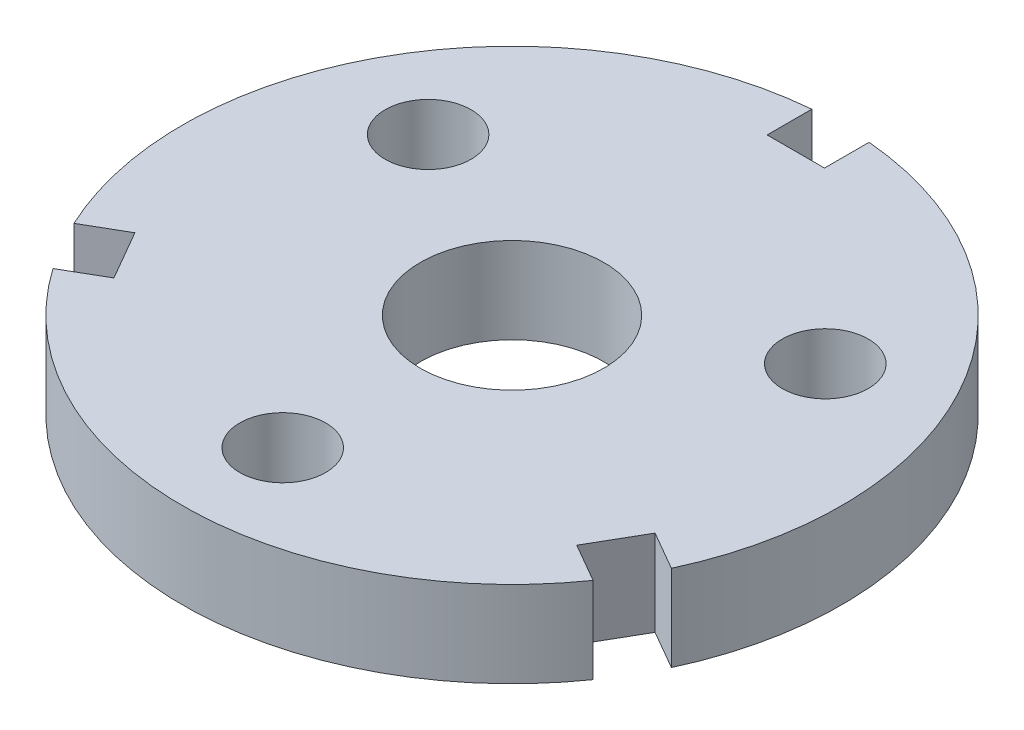
ISO-10303-21;
HEADER;
FILE_DESCRIPTION(('STEP AP214'),'2;1');
FILE_NAME('part.step','',(''),(''),'','','');
FILE_SCHEMA(('AUTOMOTIVE_DESIGN { 1 0 10303 214 1 1 1 1 }'));
ENDSEC;
DATA;
#1=APPLICATION_CONTEXT('core data for automotive mechanical design processes');
#2=APPLICATION_PROTOCOL_DEFINITION('international standard','automotive_design',2000,#1);
#3=PRODUCT_CONTEXT('',#1,'mechanical');
#4=PRODUCT('Part','Part','',(#3));
#5=PRODUCT_RELATED_PRODUCT_CATEGORY('part','',(#4));
#6=PRODUCT_DEFINITION_FORMATION('','',#4);
#7=PRODUCT_DEFINITION_CONTEXT('part definition',#1,'design');
#8=PRODUCT_DEFINITION('design','',#6,#7);
#9=PRODUCT_DEFINITION_SHAPE('','',#8);
#10=(LENGTH_UNIT() NAMED_UNIT(*) SI_UNIT(.MILLI.,.METRE.));
#11=(NAMED_UNIT(*) PLANE_ANGLE_UNIT() SI_UNIT($,.RADIAN.));
#12=(NAMED_UNIT(*) SI_UNIT($,.STERADIAN.) SOLID_ANGLE_UNIT());
#13=UNCERTAINTY_MEASURE_WITH_UNIT(LENGTH_MEASURE(1.E-05),#10,'distance_accuracy_value','');
#14=(GEOMETRIC_REPRESENTATION_CONTEXT(3) GLOBAL_UNCERTAINTY_ASSIGNED_CONTEXT((#13)) GLOBAL_UNIT_ASSIGNED_CONTEXT((#10,
#11,#12)) REPRESENTATION_CONTEXT('',''));
#15=CARTESIAN_POINT('',(0.,0.,0.));
#16=DIRECTION('',(0.,0.,1.));
#17=DIRECTION('',(1.,0.,0.));
#18=AXIS2_PLACEMENT_3D('',#15,#16,#17);
#19=CARTESIAN_POINT('',(0.,15.,0.));
#20=DIRECTION('',(0.,1.,0.));
#21=DIRECTION('',(0.,0.,1.));
#22=AXIS2_PLACEMENT_3D('',#19,#20,#21);
#23=PLANE('',#22);
#24=CARTESIAN_POINT('',(4.60582016832331E-12,15.,40.0000000000013));
#25=DIRECTION('',(0.,1.,0.));
#26=DIRECTION('',(0.,0.,1.));
#27=AXIS2_PLACEMENT_3D('',#24,#25,#26);
#28=CIRCLE('',#27,7.49999999999981);
#29=CARTESIAN_POINT('',(4.60582016832331E-12,15.,47.5000000000011));
#30=VERTEX_POINT('',#29);
#31=EDGE_CURVE('E336',#30,#30,#28,.T.);
#32=ORIENTED_EDGE('',*,*,#31,.F.);
#33=EDGE_LOOP('',(#32));
#34=FACE_BOUND('',#33,.T.);
#35=CARTESIAN_POINT('',(0.,15.,0.));
#36=DIRECTION('',(0.,1.,0.));
#37=DIRECTION('',(0.,0.,1.));
#38=AXIS2_PLACEMENT_3D('',#35,#36,#37);
#39=CIRCLE('',#38,16.);
#40=CARTESIAN_POINT('',(0.,15.,16.));
#41=VERTEX_POINT('',#40);
#42=EDGE_CURVE('E174',#41,#41,#39,.T.);
#43=ORIENTED_EDGE('',*,*,#42,.F.);
#44=EDGE_LOOP('',(#43));
#45=FACE_BOUND('',#44,.T.);
#46=CARTESIAN_POINT('',(0.,15.,0.));
#47=DIRECTION('',(0.,1.,0.));
#48=DIRECTION('',(0.,0.,1.));
#49=AXIS2_PLACEMENT_3D('',#46,#47,#48);
#50=CIRCLE('',#49,57.5);
#51=CARTESIAN_POINT('',(-5.,15.,-57.282196186948));
#52=VERTEX_POINT('',#51);
#53=CARTESIAN_POINT('',(-52.1078370824611,15.,24.3109710745518));
#54=VERTEX_POINT('',#53);
#55=EDGE_CURVE('E204',#52,#54,#50,.T.);
#56=ORIENTED_EDGE('',*,*,#55,.T.);
#57=DIRECTION('',(0.866025403784438,0.,-0.5));
#58=VECTOR('',#57,1.);
#59=CARTESIAN_POINT('',(-45.3682574873297,15.,20.4198729810778));
#60=LINE('',#59,#58);
#61=CARTESIAN_POINT('',(-45.3682574873297,15.,20.4198729810778));
#62=VERTEX_POINT('',#61);
#63=EDGE_CURVE('E116',#54,#62,#60,.T.);
#64=ORIENTED_EDGE('',*,*,#63,.T.);
#65=DIRECTION('',(0.5,0.,0.866025403784438));
#66=VECTOR('',#65,1.);
#67=CARTESIAN_POINT('',(-40.3682574873297,15.,29.0801270189222));
#68=LINE('',#67,#66);
#69=CARTESIAN_POINT('',(-40.3682574873297,15.,29.0801270189222));
#70=VERTEX_POINT('',#69);
#71=EDGE_CURVE('E241',#62,#70,#68,.T.);
#72=ORIENTED_EDGE('',*,*,#71,.T.);
#73=DIRECTION('',(-0.866025403784439,0.,0.5));
#74=VECTOR('',#73,1.);
#75=CARTESIAN_POINT('',(-47.1078370824611,15.,32.9712251123962));
#76=LINE('',#75,#74);
#77=CARTESIAN_POINT('',(-47.1078370824611,15.,32.9712251123962));
#78=VERTEX_POINT('',#77);
#79=EDGE_CURVE('E261',#70,#78,#76,.T.);
#80=ORIENTED_EDGE('',*,*,#79,.T.);
#81=CARTESIAN_POINT('',(0.,15.,0.));
#82=DIRECTION('',(0.,1.,0.));
#83=DIRECTION('',(0.,0.,1.));
#84=AXIS2_PLACEMENT_3D('',#81,#82,#83);
#85=CIRCLE('',#84,57.5);
#86=CARTESIAN_POINT('',(47.1078370824611,15.,32.9712251123962));
#87=VERTEX_POINT('',#86);
#88=EDGE_CURVE('E257',#78,#87,#85,.T.);
#89=ORIENTED_EDGE('',*,*,#88,.T.);
#90=DIRECTION('',(-0.866025403784439,0.,-0.5));
#91=VECTOR('',#90,1.);
#92=CARTESIAN_POINT('',(40.3682574873297,15.,29.0801270189222));
#93=LINE('',#92,#91);
#94=CARTESIAN_POINT('',(40.3682574873297,15.,29.0801270189222));
#95=VERTEX_POINT('',#94);
#96=EDGE_CURVE('E260',#87,#95,#93,.T.);
#97=ORIENTED_EDGE('',*,*,#96,.T.);
#98=DIRECTION('',(0.5,0.,-0.866025403784438));
#99=VECTOR('',#98,1.);
#100=CARTESIAN_POINT('',(45.3682574873297,15.,20.4198729810778));
#101=LINE('',#100,#99);
#102=CARTESIAN_POINT('',(45.3682574873297,15.,20.4198729810778));
#103=VERTEX_POINT('',#102);
#104=EDGE_CURVE('E265',#95,#103,#101,.T.);
#105=ORIENTED_EDGE('',*,*,#104,.T.);
#106=DIRECTION('',(0.866025403784439,0.,0.5));
#107=VECTOR('',#106,1.);
#108=CARTESIAN_POINT('',(52.1078370824611,15.,24.3109710745518));
#109=LINE('',#108,#107);
#110=CARTESIAN_POINT('',(52.1078370824611,15.,24.3109710745518));
#111=VERTEX_POINT('',#110);
#112=EDGE_CURVE('E272',#103,#111,#109,.T.);
#113=ORIENTED_EDGE('',*,*,#112,.T.);
#114=CARTESIAN_POINT('',(0.,15.,0.));
#115=DIRECTION('',(0.,1.,0.));
#116=DIRECTION('',(0.,0.,1.));
#117=AXIS2_PLACEMENT_3D('',#114,#115,#116);
#118=CIRCLE('',#117,57.5);
#119=CARTESIAN_POINT('',(5.,15.,-57.282196186948));
#120=VERTEX_POINT('',#119);
#121=EDGE_CURVE('E147',#111,#120,#118,.T.);
#122=ORIENTED_EDGE('',*,*,#121,.T.);
#123=DIRECTION('',(0.,0.,1.));
#124=VECTOR('',#123,1.);
#125=CARTESIAN_POINT('',(5.,15.,-49.5));
#126=LINE('',#125,#124);
#127=CARTESIAN_POINT('',(5.,15.,-49.5));
#128=VERTEX_POINT('',#127);
#129=EDGE_CURVE('E141',#120,#128,#126,.T.);
#130=ORIENTED_EDGE('',*,*,#129,.T.);
#131=DIRECTION('',(-1.,0.,0.));
#132=VECTOR('',#131,1.);
#133=CARTESIAN_POINT('',(-5.,15.,-49.5));
#134=LINE('',#133,#132);
#135=CARTESIAN_POINT('',(-5.,15.,-49.5));
#136=VERTEX_POINT('',#135);
#137=EDGE_CURVE('E145',#128,#136,#134,.T.);
#138=ORIENTED_EDGE('',*,*,#137,.T.);
#139=DIRECTION('',(0.,0.,-1.));
#140=VECTOR('',#139,1.);
#141=CARTESIAN_POINT('',(-5.,15.,-57.282196186948));
#142=LINE('',#141,#140);
#143=EDGE_CURVE('E61',#136,#52,#142,.T.);
#144=ORIENTED_EDGE('',*,*,#143,.T.);
#145=EDGE_LOOP('',(#56,#64,#72,#80,#89,#97,#105,#113,#122,#130,#138,#144));
#146=FACE_BOUND('',#145,.T.);
#147=CARTESIAN_POINT('',(34.6410161513763,15.,-20.0000000000017));
#148=DIRECTION('',(0.,1.,0.));
#149=DIRECTION('',(0.,0.,1.));
#150=AXIS2_PLACEMENT_3D('',#147,#148,#149);
#151=CIRCLE('',#150,7.50000000000065);
#152=CARTESIAN_POINT('',(34.6410161513763,15.,-12.5000000000011));
#153=VERTEX_POINT('',#152);
#154=EDGE_CURVE('E344',#153,#153,#151,.T.);
#155=ORIENTED_EDGE('',*,*,#154,.F.);
#156=EDGE_LOOP('',(#155));
#157=FACE_BOUND('',#156,.T.);
#158=CARTESIAN_POINT('',(-34.6410161513785,15.,-19.9999999999952));
#159=DIRECTION('',(0.,1.,0.));
#160=DIRECTION('',(0.,0.,1.));
#161=AXIS2_PLACEMENT_3D('',#158,#159,#160);
#162=CIRCLE('',#161,7.50000000000269);
#163=CARTESIAN_POINT('',(-34.6410161513785,15.,-12.4999999999925));
#164=VERTEX_POINT('',#163);
#165=EDGE_CURVE('E325',#164,#164,#162,.T.);
#166=ORIENTED_EDGE('',*,*,#165,.F.);
#167=EDGE_LOOP('',(#166));
#168=FACE_BOUND('',#167,.T.);
#169=ADVANCED_FACE('F43',(#34,#45,#146,#157,#168),#23,.T.);
#170=CARTESIAN_POINT('',(0.,0.,0.));
#171=DIRECTION('',(0.,1.,0.));
#172=DIRECTION('',(0.,0.,1.));
#173=AXIS2_PLACEMENT_3D('',#170,#171,#172);
#174=PLANE('',#173);
#175=CARTESIAN_POINT('',(0.,0.,0.));
#176=DIRECTION('',(0.,1.,0.));
#177=DIRECTION('',(0.,0.,1.));
#178=AXIS2_PLACEMENT_3D('',#175,#176,#177);
#179=CIRCLE('',#178,57.5);
#180=CARTESIAN_POINT('',(-5.,0.,-57.282196186948));
#181=VERTEX_POINT('',#180);
#182=CARTESIAN_POINT('',(-52.1078370824611,0.,24.3109710745518));
#183=VERTEX_POINT('',#182);
#184=EDGE_CURVE('E169',#181,#183,#179,.T.);
#185=ORIENTED_EDGE('',*,*,#184,.F.);
#186=DIRECTION('',(0.,0.,-1.));
#187=VECTOR('',#186,1.);
#188=CARTESIAN_POINT('',(-5.,0.,-57.282196186948));
#189=LINE('',#188,#187);
#190=CARTESIAN_POINT('',(-5.,0.,-49.5));
#191=VERTEX_POINT('',#190);
#192=EDGE_CURVE('E108',#191,#181,#189,.T.);
#193=ORIENTED_EDGE('',*,*,#192,.F.);
#194=DIRECTION('',(-1.,0.,0.));
#195=VECTOR('',#194,1.);
#196=CARTESIAN_POINT('',(-5.,0.,-49.5));
#197=LINE('',#196,#195);
#198=CARTESIAN_POINT('',(5.,0.,-49.5));
#199=VERTEX_POINT('',#198);
#200=EDGE_CURVE('E102',#199,#191,#197,.T.);
#201=ORIENTED_EDGE('',*,*,#200,.F.);
#202=DIRECTION('',(0.,0.,1.));
#203=VECTOR('',#202,1.);
#204=CARTESIAN_POINT('',(5.,0.,-49.5));
#205=LINE('',#204,#203);
#206=CARTESIAN_POINT('',(5.,0.,-57.282196186948));
#207=VERTEX_POINT('',#206);
#208=EDGE_CURVE('E156',#207,#199,#205,.T.);
#209=ORIENTED_EDGE('',*,*,#208,.F.);
#210=CARTESIAN_POINT('',(0.,0.,0.));
#211=DIRECTION('',(0.,1.,0.));
#212=DIRECTION('',(0.,0.,1.));
#213=AXIS2_PLACEMENT_3D('',#210,#211,#212);
#214=CIRCLE('',#213,57.5);
#215=CARTESIAN_POINT('',(52.1078370824611,0.,24.3109710745518));
#216=VERTEX_POINT('',#215);
#217=EDGE_CURVE('E195',#216,#207,#214,.T.);
#218=ORIENTED_EDGE('',*,*,#217,.F.);
#219=DIRECTION('',(0.866025403784439,0.,0.5));
#220=VECTOR('',#219,1.);
#221=CARTESIAN_POINT('',(52.1078370824611,0.,24.3109710745518));
#222=LINE('',#221,#220);
#223=CARTESIAN_POINT('',(45.3682574873297,0.,20.4198729810778));
#224=VERTEX_POINT('',#223);
#225=EDGE_CURVE('E192',#224,#216,#222,.T.);
#226=ORIENTED_EDGE('',*,*,#225,.F.);
#227=DIRECTION('',(0.5,0.,-0.866025403784438));
#228=VECTOR('',#227,1.);
#229=CARTESIAN_POINT('',(45.3682574873297,0.,20.4198729810778));
#230=LINE('',#229,#228);
#231=CARTESIAN_POINT('',(40.3682574873297,0.,29.0801270189222));
#232=VERTEX_POINT('',#231);
#233=EDGE_CURVE('E189',#232,#224,#230,.T.);
#234=ORIENTED_EDGE('',*,*,#233,.F.);
#235=DIRECTION('',(-0.866025403784439,0.,-0.5));
#236=VECTOR('',#235,1.);
#237=CARTESIAN_POINT('',(40.3682574873297,0.,29.0801270189222));
#238=LINE('',#237,#236);
#239=CARTESIAN_POINT('',(47.1078370824611,0.,32.9712251123962));
#240=VERTEX_POINT('',#239);
#241=EDGE_CURVE('E186',#240,#232,#238,.T.);
#242=ORIENTED_EDGE('',*,*,#241,.F.);
#243=CARTESIAN_POINT('',(0.,0.,0.));
#244=DIRECTION('',(0.,1.,0.));
#245=DIRECTION('',(0.,0.,1.));
#246=AXIS2_PLACEMENT_3D('',#243,#244,#245);
#247=CIRCLE('',#246,57.5);
#248=CARTESIAN_POINT('',(-47.1078370824611,0.,32.9712251123962));
#249=VERTEX_POINT('',#248);
#250=EDGE_CURVE('E183',#249,#240,#247,.T.);
#251=ORIENTED_EDGE('',*,*,#250,.F.);
#252=DIRECTION('',(-0.866025403784439,0.,0.5));
#253=VECTOR('',#252,1.);
#254=CARTESIAN_POINT('',(-47.1078370824611,0.,32.9712251123962));
#255=LINE('',#254,#253);
#256=CARTESIAN_POINT('',(-40.3682574873297,0.,29.0801270189222));
#257=VERTEX_POINT('',#256);
#258=EDGE_CURVE('E180',#257,#249,#255,.T.);
#259=ORIENTED_EDGE('',*,*,#258,.F.);
#260=DIRECTION('',(0.5,0.,0.866025403784438));
#261=VECTOR('',#260,1.);
#262=CARTESIAN_POINT('',(-40.3682574873297,0.,29.0801270189222));
#263=LINE('',#262,#261);
#264=CARTESIAN_POINT('',(-45.3682574873297,0.,20.4198729810778));
#265=VERTEX_POINT('',#264);
#266=EDGE_CURVE('E177',#265,#257,#263,.T.);
#267=ORIENTED_EDGE('',*,*,#266,.F.);
#268=DIRECTION('',(0.866025403784438,0.,-0.5));
#269=VECTOR('',#268,1.);
#270=CARTESIAN_POINT('',(-45.3682574873297,0.,20.4198729810778));
#271=LINE('',#270,#269);
#272=EDGE_CURVE('E173',#183,#265,#271,.T.);
#273=ORIENTED_EDGE('',*,*,#272,.F.);
#274=EDGE_LOOP('',(#185,#193,#201,#209,#218,#226,#234,#242,#251,#259,#267,#273));
#275=FACE_BOUND('',#274,.T.);
#276=CARTESIAN_POINT('',(0.,0.,0.));
#277=DIRECTION('',(0.,1.,0.));
#278=DIRECTION('',(0.,0.,1.));
#279=AXIS2_PLACEMENT_3D('',#276,#277,#278);
#280=CIRCLE('',#279,16.);
#281=CARTESIAN_POINT('',(0.,0.,16.));
#282=VERTEX_POINT('',#281);
#283=EDGE_CURVE('E348',#282,#282,#280,.T.);
#284=ORIENTED_EDGE('',*,*,#283,.T.);
#285=EDGE_LOOP('',(#284));
#286=FACE_BOUND('',#285,.T.);
#287=CARTESIAN_POINT('',(34.6410161513763,0.,-20.0000000000017));
#288=DIRECTION('',(0.,1.,0.));
#289=DIRECTION('',(0.,0.,1.));
#290=AXIS2_PLACEMENT_3D('',#287,#288,#289);
#291=CIRCLE('',#290,7.50000000000065);
#292=CARTESIAN_POINT('',(34.6410161513763,0.,-12.5000000000011));
#293=VERTEX_POINT('',#292);
#294=EDGE_CURVE('E340',#293,#293,#291,.T.);
#295=ORIENTED_EDGE('',*,*,#294,.T.);
#296=EDGE_LOOP('',(#295));
#297=FACE_BOUND('',#296,.T.);
#298=CARTESIAN_POINT('',(4.60582016832331E-12,0.,40.0000000000013));
#299=DIRECTION('',(0.,1.,0.));
#300=DIRECTION('',(0.,0.,1.));
#301=AXIS2_PLACEMENT_3D('',#298,#299,#300);
#302=CIRCLE('',#301,7.49999999999981);
#303=CARTESIAN_POINT('',(4.60582016832331E-12,0.,47.5000000000011));
#304=VERTEX_POINT('',#303);
#305=EDGE_CURVE('E333',#304,#304,#302,.T.);
#306=ORIENTED_EDGE('',*,*,#305,.T.);
#307=EDGE_LOOP('',(#306));
#308=FACE_BOUND('',#307,.T.);
#309=CARTESIAN_POINT('',(-34.6410161513785,0.,-19.9999999999952));
#310=DIRECTION('',(0.,1.,0.));
#311=DIRECTION('',(0.,0.,1.));
#312=AXIS2_PLACEMENT_3D('',#309,#310,#311);
#313=CIRCLE('',#312,7.50000000000269);
#314=CARTESIAN_POINT('',(-34.6410161513785,0.,-12.4999999999925));
#315=VERTEX_POINT('',#314);
#316=EDGE_CURVE('E328',#315,#315,#313,.T.);
#317=ORIENTED_EDGE('',*,*,#316,.T.);
#318=EDGE_LOOP('',(#317));
#319=FACE_BOUND('',#318,.T.);
#320=ADVANCED_FACE('F245',(#275,#286,#297,#308,#319),#174,.F.);
#321=CARTESIAN_POINT('',(0.,15.,0.));
#322=DIRECTION('',(0.,-1.,0.));
#323=DIRECTION('',(0.,0.,-1.));
#324=AXIS2_PLACEMENT_3D('',#321,#322,#323);
#325=CYLINDRICAL_SURFACE('',#324,57.5);
#326=ORIENTED_EDGE('',*,*,#184,.T.);
#327=DIRECTION('',(0.,-1.,0.));
#328=VECTOR('',#327,1.);
#329=CARTESIAN_POINT('',(-52.1078370824611,15.,24.3109710745518));
#330=LINE('',#329,#328);
#331=EDGE_CURVE('E11',#54,#183,#330,.T.);
#332=ORIENTED_EDGE('',*,*,#331,.F.);
#333=ORIENTED_EDGE('',*,*,#55,.F.);
#334=DIRECTION('',(0.,-1.,0.));
#335=VECTOR('',#334,1.);
#336=CARTESIAN_POINT('',(-5.,15.,-57.282196186948));
#337=LINE('',#336,#335);
#338=EDGE_CURVE('E165',#52,#181,#337,.T.);
#339=ORIENTED_EDGE('',*,*,#338,.T.);
#340=EDGE_LOOP('',(#326,#332,#333,#339));
#341=FACE_BOUND('',#340,.T.);
#342=ADVANCED_FACE('F45',(#341),#325,.T.);
#343=CARTESIAN_POINT('',(-45.3682574873297,15.,20.4198729810778));
#344=DIRECTION('',(-0.5,0.,-0.866025403784438));
#345=DIRECTION('',(-0.866025403784438,0.,0.5));
#346=AXIS2_PLACEMENT_3D('',#343,#344,#345);
#347=PLANE('',#346);
#348=ORIENTED_EDGE('',*,*,#272,.T.);
#349=DIRECTION('',(0.,-1.,0.));
#350=VECTOR('',#349,1.);
#351=CARTESIAN_POINT('',(-45.3682574873297,15.,20.4198729810778));
#352=LINE('',#351,#350);
#353=EDGE_CURVE('E53',#62,#265,#352,.T.);
#354=ORIENTED_EDGE('',*,*,#353,.F.);
#355=ORIENTED_EDGE('',*,*,#63,.F.);
#356=ORIENTED_EDGE('',*,*,#331,.T.);
#357=EDGE_LOOP('',(#348,#354,#355,#356));
#358=FACE_BOUND('',#357,.T.);
#359=ADVANCED_FACE('F474',(#358),#347,.F.);
#360=CARTESIAN_POINT('',(-40.3682574873297,15.,29.0801270189222));
#361=DIRECTION('',(0.866025403784438,0.,-0.5));
#362=DIRECTION('',(-0.5,0.,-0.866025403784438));
#363=AXIS2_PLACEMENT_3D('',#360,#361,#362);
#364=PLANE('',#363);
#365=ORIENTED_EDGE('',*,*,#266,.T.);
#366=DIRECTION('',(0.,-1.,0.));
#367=VECTOR('',#366,1.);
#368=CARTESIAN_POINT('',(-40.3682574873297,15.,29.0801270189222));
#369=LINE('',#368,#367);
#370=EDGE_CURVE('E231',#70,#257,#369,.T.);
#371=ORIENTED_EDGE('',*,*,#370,.F.);
#372=ORIENTED_EDGE('',*,*,#71,.F.);
#373=ORIENTED_EDGE('',*,*,#353,.T.);
#374=EDGE_LOOP('',(#365,#371,#372,#373));
#375=FACE_BOUND('',#374,.T.);
#376=ADVANCED_FACE('F239',(#375),#364,.F.);
#377=CARTESIAN_POINT('',(-47.1078370824611,15.,32.9712251123962));
#378=DIRECTION('',(0.5,0.,0.866025403784439));
#379=DIRECTION('',(0.866025403784439,0.,-0.5));
#380=AXIS2_PLACEMENT_3D('',#377,#378,#379);
#381=PLANE('',#380);
#382=ORIENTED_EDGE('',*,*,#258,.T.);
#383=DIRECTION('',(0.,-1.,0.));
#384=VECTOR('',#383,1.);
#385=CARTESIAN_POINT('',(-47.1078370824611,15.,32.9712251123962));
#386=LINE('',#385,#384);
#387=EDGE_CURVE('E227',#78,#249,#386,.T.);
#388=ORIENTED_EDGE('',*,*,#387,.F.);
#389=ORIENTED_EDGE('',*,*,#79,.F.);
#390=ORIENTED_EDGE('',*,*,#370,.T.);
#391=EDGE_LOOP('',(#382,#388,#389,#390));
#392=FACE_BOUND('',#391,.T.);
#393=ADVANCED_FACE('F251',(#392),#381,.F.);
#394=CARTESIAN_POINT('',(0.,15.,0.));
#395=DIRECTION('',(0.,-1.,0.));
#396=DIRECTION('',(0.,0.,-1.));
#397=AXIS2_PLACEMENT_3D('',#394,#395,#396);
#398=CYLINDRICAL_SURFACE('',#397,57.5);
#399=ORIENTED_EDGE('',*,*,#250,.T.);
#400=DIRECTION('',(0.,-1.,0.));
#401=VECTOR('',#400,1.);
#402=CARTESIAN_POINT('',(47.1078370824611,15.,32.9712251123962));
#403=LINE('',#402,#401);
#404=EDGE_CURVE('E223',#87,#240,#403,.T.);
#405=ORIENTED_EDGE('',*,*,#404,.F.);
#406=ORIENTED_EDGE('',*,*,#88,.F.);
#407=ORIENTED_EDGE('',*,*,#387,.T.);
#408=EDGE_LOOP('',(#399,#405,#406,#407));
#409=FACE_BOUND('',#408,.T.);
#410=ADVANCED_FACE('F255',(#409),#398,.T.);
#411=CARTESIAN_POINT('',(40.3682574873297,15.,29.0801270189222));
#412=DIRECTION('',(-0.5,0.,0.866025403784439));
#413=DIRECTION('',(0.866025403784439,0.,0.5));
#414=AXIS2_PLACEMENT_3D('',#411,#412,#413);
#415=PLANE('',#414);
#416=ORIENTED_EDGE('',*,*,#241,.T.);
#417=DIRECTION('',(0.,-1.,0.));
#418=VECTOR('',#417,1.);
#419=CARTESIAN_POINT('',(40.3682574873297,15.,29.0801270189222));
#420=LINE('',#419,#418);
#421=EDGE_CURVE('E219',#95,#232,#420,.T.);
#422=ORIENTED_EDGE('',*,*,#421,.F.);
#423=ORIENTED_EDGE('',*,*,#96,.F.);
#424=ORIENTED_EDGE('',*,*,#404,.T.);
#425=EDGE_LOOP('',(#416,#422,#423,#424));
#426=FACE_BOUND('',#425,.T.);
#427=ADVANCED_FACE('F435',(#426),#415,.F.);
#428=CARTESIAN_POINT('',(45.3682574873297,15.,20.4198729810778));
#429=DIRECTION('',(-0.866025403784438,0.,-0.5));
#430=DIRECTION('',(-0.5,0.,0.866025403784438));
#431=AXIS2_PLACEMENT_3D('',#428,#429,#430);
#432=PLANE('',#431);
#433=ORIENTED_EDGE('',*,*,#233,.T.);
#434=DIRECTION('',(0.,-1.,0.));
#435=VECTOR('',#434,1.);
#436=CARTESIAN_POINT('',(45.3682574873297,15.,20.4198729810778));
#437=LINE('',#436,#435);
#438=EDGE_CURVE('E215',#103,#224,#437,.T.);
#439=ORIENTED_EDGE('',*,*,#438,.F.);
#440=ORIENTED_EDGE('',*,*,#104,.F.);
#441=ORIENTED_EDGE('',*,*,#421,.T.);
#442=EDGE_LOOP('',(#433,#439,#440,#441));
#443=FACE_BOUND('',#442,.T.);
#444=ADVANCED_FACE('F425',(#443),#432,.F.);
#445=CARTESIAN_POINT('',(52.1078370824611,15.,24.3109710745518));
#446=DIRECTION('',(0.5,0.,-0.866025403784439));
#447=DIRECTION('',(-0.866025403784439,0.,-0.5));
#448=AXIS2_PLACEMENT_3D('',#445,#446,#447);
#449=PLANE('',#448);
#450=ORIENTED_EDGE('',*,*,#225,.T.);
#451=DIRECTION('',(0.,-1.,0.));
#452=VECTOR('',#451,1.);
#453=CARTESIAN_POINT('',(52.1078370824611,15.,24.3109710745518));
#454=LINE('',#453,#452);
#455=EDGE_CURVE('E211',#111,#216,#454,.T.);
#456=ORIENTED_EDGE('',*,*,#455,.F.);
#457=ORIENTED_EDGE('',*,*,#112,.F.);
#458=ORIENTED_EDGE('',*,*,#438,.T.);
#459=EDGE_LOOP('',(#450,#456,#457,#458));
#460=FACE_BOUND('',#459,.T.);
#461=ADVANCED_FACE('F280',(#460),#449,.F.);
#462=CARTESIAN_POINT('',(0.,15.,0.));
#463=DIRECTION('',(0.,-1.,0.));
#464=DIRECTION('',(0.,0.,-1.));
#465=AXIS2_PLACEMENT_3D('',#462,#463,#464);
#466=CYLINDRICAL_SURFACE('',#465,57.5);
#467=ORIENTED_EDGE('',*,*,#217,.T.);
#468=DIRECTION('',(0.,-1.,0.));
#469=VECTOR('',#468,1.);
#470=CARTESIAN_POINT('',(5.,15.,-57.282196186948));
#471=LINE('',#470,#469);
#472=EDGE_CURVE('E158',#120,#207,#471,.T.);
#473=ORIENTED_EDGE('',*,*,#472,.F.);
#474=ORIENTED_EDGE('',*,*,#121,.F.);
#475=ORIENTED_EDGE('',*,*,#455,.T.);
#476=EDGE_LOOP('',(#467,#473,#474,#475));
#477=FACE_BOUND('',#476,.T.);
#478=ADVANCED_FACE('F284',(#477),#466,.T.);
#479=CARTESIAN_POINT('',(5.,15.,-49.5));
#480=DIRECTION('',(1.,0.,0.));
#481=DIRECTION('',(0.,0.,-1.));
#482=AXIS2_PLACEMENT_3D('',#479,#480,#481);
#483=PLANE('',#482);
#484=ORIENTED_EDGE('',*,*,#208,.T.);
#485=DIRECTION('',(0.,-1.,0.));
#486=VECTOR('',#485,1.);
#487=CARTESIAN_POINT('',(5.,15.,-49.5));
#488=LINE('',#487,#486);
#489=EDGE_CURVE('E153',#128,#199,#488,.T.);
#490=ORIENTED_EDGE('',*,*,#489,.F.);
#491=ORIENTED_EDGE('',*,*,#129,.F.);
#492=ORIENTED_EDGE('',*,*,#472,.T.);
#493=EDGE_LOOP('',(#484,#490,#491,#492));
#494=FACE_BOUND('',#493,.T.);
#495=ADVANCED_FACE('F154',(#494),#483,.F.);
#496=CARTESIAN_POINT('',(-5.,15.,-49.5));
#497=DIRECTION('',(0.,0.,1.));
#498=DIRECTION('',(1.,0.,0.));
#499=AXIS2_PLACEMENT_3D('',#496,#497,#498);
#500=PLANE('',#499);
#501=ORIENTED_EDGE('',*,*,#200,.T.);
#502=DIRECTION('',(0.,-1.,0.));
#503=VECTOR('',#502,1.);
#504=CARTESIAN_POINT('',(-5.,15.,-49.5));
#505=LINE('',#504,#503);
#506=EDGE_CURVE('E159',#136,#191,#505,.T.);
#507=ORIENTED_EDGE('',*,*,#506,.F.);
#508=ORIENTED_EDGE('',*,*,#137,.F.);
#509=ORIENTED_EDGE('',*,*,#489,.T.);
#510=EDGE_LOOP('',(#501,#507,#508,#509));
#511=FACE_BOUND('',#510,.T.);
#512=ADVANCED_FACE('F161',(#511),#500,.F.);
#513=CARTESIAN_POINT('',(-5.,15.,-57.282196186948));
#514=DIRECTION('',(-1.,0.,0.));
#515=DIRECTION('',(0.,0.,1.));
#516=AXIS2_PLACEMENT_3D('',#513,#514,#515);
#517=PLANE('',#516);
#518=ORIENTED_EDGE('',*,*,#192,.T.);
#519=ORIENTED_EDGE('',*,*,#338,.F.);
#520=ORIENTED_EDGE('',*,*,#143,.F.);
#521=ORIENTED_EDGE('',*,*,#506,.T.);
#522=EDGE_LOOP('',(#518,#519,#520,#521));
#523=FACE_BOUND('',#522,.T.);
#524=ADVANCED_FACE('F288',(#523),#517,.F.);
#525=CARTESIAN_POINT('',(0.,15.,0.));
#526=DIRECTION('',(0.,-1.,0.));
#527=DIRECTION('',(0.,0.,-1.));
#528=AXIS2_PLACEMENT_3D('',#525,#526,#527);
#529=CYLINDRICAL_SURFACE('',#528,16.);
#530=ORIENTED_EDGE('',*,*,#42,.T.);
#531=EDGE_LOOP('',(#530));
#532=FACE_BOUND('',#531,.T.);
#533=ORIENTED_EDGE('',*,*,#283,.F.);
#534=EDGE_LOOP('',(#533));
#535=FACE_BOUND('',#534,.T.);
#536=ADVANCED_FACE('F290',(#532,#535),#529,.F.);
#537=CARTESIAN_POINT('',(34.6410161513763,15.,-20.0000000000017));
#538=DIRECTION('',(0.,-1.,0.));
#539=DIRECTION('',(0.,0.,-1.));
#540=AXIS2_PLACEMENT_3D('',#537,#538,#539);
#541=CYLINDRICAL_SURFACE('',#540,7.50000000000065);
#542=ORIENTED_EDGE('',*,*,#154,.T.);
#543=EDGE_LOOP('',(#542));
#544=FACE_BOUND('',#543,.T.);
#545=ORIENTED_EDGE('',*,*,#294,.F.);
#546=EDGE_LOOP('',(#545));
#547=FACE_BOUND('',#546,.T.);
#548=ADVANCED_FACE('F296',(#544,#547),#541,.F.);
#549=CARTESIAN_POINT('',(4.60582016832331E-12,15.,40.0000000000013));
#550=DIRECTION('',(0.,-1.,0.));
#551=DIRECTION('',(0.,0.,-1.));
#552=AXIS2_PLACEMENT_3D('',#549,#550,#551);
#553=CYLINDRICAL_SURFACE('',#552,7.49999999999981);
#554=ORIENTED_EDGE('',*,*,#31,.T.);
#555=EDGE_LOOP('',(#554));
#556=FACE_BOUND('',#555,.T.);
#557=ORIENTED_EDGE('',*,*,#305,.F.);
#558=EDGE_LOOP('',(#557));
#559=FACE_BOUND('',#558,.T.);
#560=ADVANCED_FACE('F312',(#556,#559),#553,.F.);
#561=CARTESIAN_POINT('',(-34.6410161513785,15.,-19.9999999999952));
#562=DIRECTION('',(0.,-1.,0.));
#563=DIRECTION('',(0.,0.,-1.));
#564=AXIS2_PLACEMENT_3D('',#561,#562,#563);
#565=CYLINDRICAL_SURFACE('',#564,7.50000000000269);
#566=ORIENTED_EDGE('',*,*,#165,.T.);
#567=EDGE_LOOP('',(#566));
#568=FACE_BOUND('',#567,.T.);
#569=ORIENTED_EDGE('',*,*,#316,.F.);
#570=EDGE_LOOP('',(#569));
#571=FACE_BOUND('',#570,.T.);
#572=ADVANCED_FACE('F316',(#568,#571),#565,.F.);
#573=CLOSED_SHELL('',(#169,#320,#342,#359,#376,#393,#410,#427,#444,#461,#478,#495,#512,#524,
#536,#548,#560,#572));
#574=MANIFOLD_SOLID_BREP('B2',#573);
#575=ADVANCED_BREP_SHAPE_REPRESENTATION('',(#18,#574),#14);
#576=SHAPE_DEFINITION_REPRESENTATION(#9,#575);
ENDSEC;
END-ISO-10303-21;
